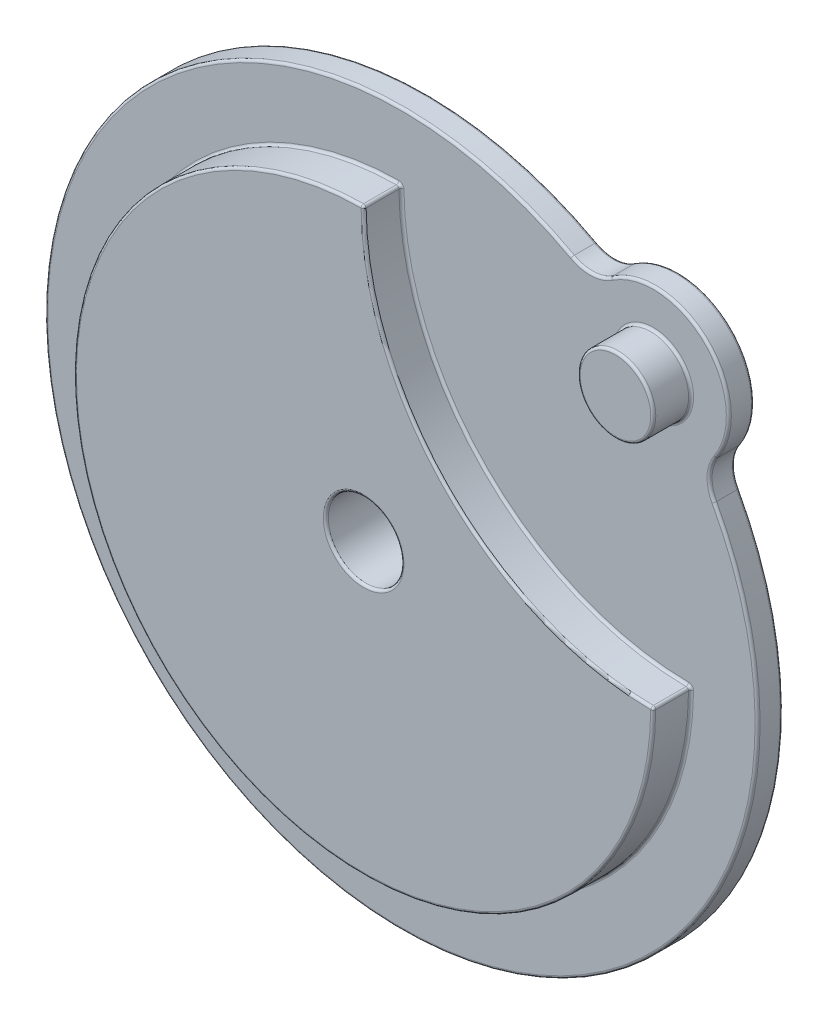
ISO-10303-21;
HEADER;
FILE_DESCRIPTION(('STEP AP214'),'2;1');
FILE_NAME('part.step','',(''),(''),'','','');
FILE_SCHEMA(('AUTOMOTIVE_DESIGN { 1 0 10303 214 1 1 1 1 }'));
ENDSEC;
DATA;
#1=APPLICATION_CONTEXT('core data for automotive mechanical design processes');
#2=APPLICATION_PROTOCOL_DEFINITION('international standard','automotive_design',2000,#1);
#3=PRODUCT_CONTEXT('',#1,'mechanical');
#4=PRODUCT('Part','Part','',(#3));
#5=PRODUCT_RELATED_PRODUCT_CATEGORY('part','',(#4));
#6=PRODUCT_DEFINITION_FORMATION('','',#4);
#7=PRODUCT_DEFINITION_CONTEXT('part definition',#1,'design');
#8=PRODUCT_DEFINITION('design','',#6,#7);
#9=PRODUCT_DEFINITION_SHAPE('','',#8);
#10=(LENGTH_UNIT() NAMED_UNIT(*) SI_UNIT(.MILLI.,.METRE.));
#11=(NAMED_UNIT(*) PLANE_ANGLE_UNIT() SI_UNIT($,.RADIAN.));
#12=(NAMED_UNIT(*) SI_UNIT($,.STERADIAN.) SOLID_ANGLE_UNIT());
#13=UNCERTAINTY_MEASURE_WITH_UNIT(LENGTH_MEASURE(1.E-05),#10,'distance_accuracy_value','');
#14=(GEOMETRIC_REPRESENTATION_CONTEXT(3) GLOBAL_UNCERTAINTY_ASSIGNED_CONTEXT((#13)) GLOBAL_UNIT_ASSIGNED_CONTEXT((#10,
#11,#12)) REPRESENTATION_CONTEXT('',''));
#15=CARTESIAN_POINT('',(0.,0.,0.));
#16=DIRECTION('',(0.,0.,1.));
#17=DIRECTION('',(1.,0.,0.));
#18=AXIS2_PLACEMENT_3D('',#15,#16,#17);
#19=CARTESIAN_POINT('',(-31.3325275695751,37.4391292873732,0.));
#20=DIRECTION('',(0.,0.,1.));
#21=DIRECTION('',(1.,0.,0.));
#22=AXIS2_PLACEMENT_3D('',#19,#20,#21);
#23=PLANE('',#22);
#24=CARTESIAN_POINT('',(-25.1217414252535,137.33494486085,0.));
#25=DIRECTION('',(0.,0.,1.));
#26=DIRECTION('',(1.,0.,0.));
#27=AXIS2_PLACEMENT_3D('',#24,#25,#26);
#28=CIRCLE('',#27,16.);
#29=CARTESIAN_POINT('',(-16.1895666962745,124.060297799214,0.));
#30=VERTEX_POINT('',#29);
#31=CARTESIAN_POINT('',(-32.7808754847892,123.287252329403,0.));
#32=VERTEX_POINT('',#31);
#33=EDGE_CURVE('E210',#30,#32,#28,.F.);
#34=ORIENTED_EDGE('',*,*,#33,.T.);
#35=CARTESIAN_POINT('',(-100.,0.,0.));
#36=DIRECTION('',(0.,0.,1.));
#37=DIRECTION('',(1.,0.,0.));
#38=AXIS2_PLACEMENT_3D('',#35,#36,#37);
#39=CIRCLE('',#38,140.421356237309);
#40=CARTESIAN_POINT('',(23.2872523294033,67.2191245152107,0.));
#41=VERTEX_POINT('',#40);
#42=EDGE_CURVE('E212',#32,#41,#39,.T.);
#43=ORIENTED_EDGE('',*,*,#42,.T.);
#44=CARTESIAN_POINT('',(37.3349448608499,74.8782585747464,0.));
#45=DIRECTION('',(0.,0.,1.));
#46=DIRECTION('',(1.,0.,0.));
#47=AXIS2_PLACEMENT_3D('',#44,#45,#46);
#48=CIRCLE('',#47,16.);
#49=CARTESIAN_POINT('',(24.0602977992144,83.8104333037254,0.));
#50=VERTEX_POINT('',#49);
#51=EDGE_CURVE('E206',#41,#50,#48,.F.);
#52=ORIENTED_EDGE('',*,*,#51,.T.);
#53=CARTESIAN_POINT('',(0.,99.9999999999999,0.));
#54=DIRECTION('',(0.,0.,1.));
#55=DIRECTION('',(1.,0.,0.));
#56=AXIS2_PLACEMENT_3D('',#53,#54,#55);
#57=CIRCLE('',#56,29.);
#58=EDGE_CURVE('E208',#50,#30,#57,.T.);
#59=ORIENTED_EDGE('',*,*,#58,.T.);
#60=EDGE_LOOP('',(#34,#43,#52,#59));
#61=FACE_BOUND('',#60,.T.);
#62=CARTESIAN_POINT('',(0.,99.9999999999999,0.));
#63=DIRECTION('',(0.,0.,1.));
#64=DIRECTION('',(1.,0.,0.));
#65=AXIS2_PLACEMENT_3D('',#62,#63,#64);
#66=CIRCLE('',#65,16.);
#67=CARTESIAN_POINT('',(16.,99.9999999999999,0.));
#68=VERTEX_POINT('',#67);
#69=EDGE_CURVE('E203',#68,#68,#66,.F.);
#70=ORIENTED_EDGE('',*,*,#69,.T.);
#71=EDGE_LOOP('',(#70));
#72=FACE_BOUND('',#71,.T.);
#73=CARTESIAN_POINT('',(13.9956520095216,-0.995652009521557,0.));
#74=DIRECTION('',(0.,0.,1.));
#75=DIRECTION('',(1.,0.,0.));
#76=AXIS2_PLACEMENT_3D('',#73,#74,#75);
#77=CIRCLE('',#76,2.);
#78=CARTESIAN_POINT('',(15.9955757289868,-1.01311958863597,0.));
#79=VERTEX_POINT('',#78);
#80=CARTESIAN_POINT('',(14.012968354185,1.00427302512538,0.));
#81=VERTEX_POINT('',#80);
#82=EDGE_CURVE('E192',#79,#81,#77,.T.);
#83=ORIENTED_EDGE('',*,*,#82,.F.);
#84=CARTESIAN_POINT('',(-100.,0.,0.));
#85=DIRECTION('',(0.,0.,1.));
#86=DIRECTION('',(1.,0.,0.));
#87=AXIS2_PLACEMENT_3D('',#84,#85,#86);
#88=CIRCLE('',#87,116.);
#89=CARTESIAN_POINT('',(-101.013119588636,115.995575728987,0.));
#90=VERTEX_POINT('',#89);
#91=EDGE_CURVE('E200',#79,#90,#88,.F.);
#92=ORIENTED_EDGE('',*,*,#91,.T.);
#93=CARTESIAN_POINT('',(-100.995652009522,113.995652009522,0.));
#94=DIRECTION('',(0.,0.,1.));
#95=DIRECTION('',(1.,0.,0.));
#96=AXIS2_PLACEMENT_3D('',#93,#94,#95);
#97=CIRCLE('',#96,2.);
#98=CARTESIAN_POINT('',(-98.9957269748746,114.012968354185,0.));
#99=VERTEX_POINT('',#98);
#100=EDGE_CURVE('E197',#99,#90,#97,.T.);
#101=ORIENTED_EDGE('',*,*,#100,.F.);
#102=CARTESIAN_POINT('',(15.0000000000001,115.,0.));
#103=DIRECTION('',(0.,0.,1.));
#104=DIRECTION('',(1.,0.,0.));
#105=AXIS2_PLACEMENT_3D('',#102,#103,#104);
#106=CIRCLE('',#105,114.);
#107=EDGE_CURVE('E195',#99,#81,#106,.T.);
#108=ORIENTED_EDGE('',*,*,#107,.T.);
#109=EDGE_LOOP('',(#83,#92,#101,#108));
#110=FACE_BOUND('',#109,.T.);
#111=ADVANCED_FACE('F34',(#61,#72,#110),#23,.T.);
#112=CARTESIAN_POINT('',(37.3349448608499,74.8782585747464,-10.));
#113=DIRECTION('',(0.,0.,1.));
#114=DIRECTION('',(1.,0.,0.));
#115=AXIS2_PLACEMENT_3D('',#112,#113,#114);
#116=CYLINDRICAL_SURFACE('',#115,15.);
#117=DIRECTION('',(0.,0.,1.));
#118=VECTOR('',#117,1.);
#119=CARTESIAN_POINT('',(24.8899632405666,83.2521723831643,-10.));
#120=LINE('',#119,#118);
#121=CARTESIAN_POINT('',(24.8899632405666,83.2521723831643,-9.));
#122=VERTEX_POINT('',#121);
#123=CARTESIAN_POINT('',(24.8899632405666,83.2521723831643,-0.999999999999999));
#124=VERTEX_POINT('',#123);
#125=EDGE_CURVE('E187',#122,#124,#120,.T.);
#126=ORIENTED_EDGE('',*,*,#125,.T.);
#127=CARTESIAN_POINT('',(37.3349448608499,74.8782585747464,-0.999999999999999));
#128=DIRECTION('',(0.,0.,1.));
#129=DIRECTION('',(1.,0.,0.));
#130=AXIS2_PLACEMENT_3D('',#127,#128,#129);
#131=CIRCLE('',#130,15.);
#132=CARTESIAN_POINT('',(24.1652331126187,67.6978203939317,-0.999999999999999));
#133=VERTEX_POINT('',#132);
#134=EDGE_CURVE('E231',#124,#133,#131,.T.);
#135=ORIENTED_EDGE('',*,*,#134,.T.);
#136=DIRECTION('',(0.,0.,1.));
#137=VECTOR('',#136,1.);
#138=CARTESIAN_POINT('',(24.1652331126187,67.6978203939317,-10.));
#139=LINE('',#138,#137);
#140=CARTESIAN_POINT('',(24.1652331126187,67.6978203939317,-9.));
#141=VERTEX_POINT('',#140);
#142=EDGE_CURVE('E181',#141,#133,#139,.T.);
#143=ORIENTED_EDGE('',*,*,#142,.F.);
#144=CARTESIAN_POINT('',(37.3349448608499,74.8782585747464,-9.));
#145=DIRECTION('',(0.,0.,1.));
#146=DIRECTION('',(1.,0.,0.));
#147=AXIS2_PLACEMENT_3D('',#144,#145,#146);
#148=CIRCLE('',#147,15.);
#149=EDGE_CURVE('E228',#141,#122,#148,.F.);
#150=ORIENTED_EDGE('',*,*,#149,.T.);
#151=EDGE_LOOP('',(#126,#135,#143,#150));
#152=FACE_BOUND('',#151,.T.);
#153=ADVANCED_FACE('F336',(#152),#116,.F.);
#154=CARTESIAN_POINT('',(-100.,0.,-10.));
#155=DIRECTION('',(0.,0.,1.));
#156=DIRECTION('',(1.,0.,0.));
#157=AXIS2_PLACEMENT_3D('',#154,#155,#156);
#158=CYLINDRICAL_SURFACE('',#157,141.421356237309);
#159=ORIENTED_EDGE('',*,*,#142,.T.);
#160=CARTESIAN_POINT('',(-100.,0.,-0.999999999999999));
#161=DIRECTION('',(0.,0.,1.));
#162=DIRECTION('',(1.,0.,0.));
#163=AXIS2_PLACEMENT_3D('',#160,#161,#162);
#164=CIRCLE('',#163,141.421356237309);
#165=CARTESIAN_POINT('',(-32.3021796060682,124.165233112619,-0.999999999999999));
#166=VERTEX_POINT('',#165);
#167=EDGE_CURVE('E217',#133,#166,#164,.F.);
#168=ORIENTED_EDGE('',*,*,#167,.T.);
#169=DIRECTION('',(0.,0.,1.));
#170=VECTOR('',#169,1.);
#171=CARTESIAN_POINT('',(-32.3021796060682,124.165233112619,-10.));
#172=LINE('',#171,#170);
#173=CARTESIAN_POINT('',(-32.3021796060682,124.165233112619,-9.));
#174=VERTEX_POINT('',#173);
#175=EDGE_CURVE('E184',#174,#166,#172,.T.);
#176=ORIENTED_EDGE('',*,*,#175,.F.);
#177=CARTESIAN_POINT('',(-100.,0.,-9.));
#178=DIRECTION('',(0.,0.,1.));
#179=DIRECTION('',(1.,0.,0.));
#180=AXIS2_PLACEMENT_3D('',#177,#178,#179);
#181=CIRCLE('',#180,141.421356237309);
#182=EDGE_CURVE('E215',#174,#141,#181,.T.);
#183=ORIENTED_EDGE('',*,*,#182,.T.);
#184=EDGE_LOOP('',(#159,#168,#176,#183));
#185=FACE_BOUND('',#184,.T.);
#186=ADVANCED_FACE('F341',(#185),#158,.T.);
#187=CARTESIAN_POINT('',(-25.1217414252535,137.33494486085,-10.));
#188=DIRECTION('',(0.,0.,1.));
#189=DIRECTION('',(1.,0.,0.));
#190=AXIS2_PLACEMENT_3D('',#187,#188,#189);
#191=CYLINDRICAL_SURFACE('',#190,15.);
#192=ORIENTED_EDGE('',*,*,#175,.T.);
#193=CARTESIAN_POINT('',(-25.1217414252535,137.33494486085,-0.999999999999999));
#194=DIRECTION('',(0.,0.,1.));
#195=DIRECTION('',(1.,0.,0.));
#196=AXIS2_PLACEMENT_3D('',#193,#194,#195);
#197=CIRCLE('',#196,15.);
#198=CARTESIAN_POINT('',(-16.7478276168357,124.889963240567,-0.999999999999999));
#199=VERTEX_POINT('',#198);
#200=EDGE_CURVE('E222',#166,#199,#197,.T.);
#201=ORIENTED_EDGE('',*,*,#200,.T.);
#202=DIRECTION('',(0.,0.,1.));
#203=VECTOR('',#202,1.);
#204=CARTESIAN_POINT('',(-16.7478276168357,124.889963240567,-10.));
#205=LINE('',#204,#203);
#206=CARTESIAN_POINT('',(-16.7478276168357,124.889963240567,-9.));
#207=VERTEX_POINT('',#206);
#208=EDGE_CURVE('E687',#207,#199,#205,.T.);
#209=ORIENTED_EDGE('',*,*,#208,.F.);
#210=CARTESIAN_POINT('',(-25.1217414252535,137.33494486085,-9.));
#211=DIRECTION('',(0.,0.,1.));
#212=DIRECTION('',(1.,0.,0.));
#213=AXIS2_PLACEMENT_3D('',#210,#211,#212);
#214=CIRCLE('',#213,15.);
#215=EDGE_CURVE('E220',#207,#174,#214,.F.);
#216=ORIENTED_EDGE('',*,*,#215,.T.);
#217=EDGE_LOOP('',(#192,#201,#209,#216));
#218=FACE_BOUND('',#217,.T.);
#219=ADVANCED_FACE('F331',(#218),#191,.F.);
#220=CARTESIAN_POINT('',(0.,99.9999999999999,-10.));
#221=DIRECTION('',(0.,0.,1.));
#222=DIRECTION('',(1.,0.,0.));
#223=AXIS2_PLACEMENT_3D('',#220,#221,#222);
#224=CYLINDRICAL_SURFACE('',#223,30.);
#225=ORIENTED_EDGE('',*,*,#208,.T.);
#226=CARTESIAN_POINT('',(0.,99.9999999999999,-0.999999999999999));
#227=DIRECTION('',(0.,0.,1.));
#228=DIRECTION('',(1.,0.,0.));
#229=AXIS2_PLACEMENT_3D('',#226,#227,#228);
#230=CIRCLE('',#229,30.);
#231=EDGE_CURVE('E226',#199,#124,#230,.F.);
#232=ORIENTED_EDGE('',*,*,#231,.T.);
#233=ORIENTED_EDGE('',*,*,#125,.F.);
#234=CARTESIAN_POINT('',(0.,99.9999999999999,-9.));
#235=DIRECTION('',(0.,0.,1.));
#236=DIRECTION('',(1.,0.,0.));
#237=AXIS2_PLACEMENT_3D('',#234,#235,#236);
#238=CIRCLE('',#237,30.);
#239=EDGE_CURVE('E224',#122,#207,#238,.T.);
#240=ORIENTED_EDGE('',*,*,#239,.T.);
#241=EDGE_LOOP('',(#225,#232,#233,#240));
#242=FACE_BOUND('',#241,.T.);
#243=ADVANCED_FACE('F321',(#242),#224,.T.);
#244=CARTESIAN_POINT('',(-31.3325275695751,37.4391292873732,-10.));
#245=DIRECTION('',(0.,0.,1.));
#246=DIRECTION('',(1.,0.,0.));
#247=AXIS2_PLACEMENT_3D('',#244,#245,#246);
#248=PLANE('',#247);
#249=CARTESIAN_POINT('',(-100.,0.,-10.));
#250=DIRECTION('',(0.,0.,1.));
#251=DIRECTION('',(1.,0.,0.));
#252=AXIS2_PLACEMENT_3D('',#249,#250,#251);
#253=CIRCLE('',#252,16.);
#254=CARTESIAN_POINT('',(-84.,0.,-10.));
#255=VERTEX_POINT('',#254);
#256=EDGE_CURVE('E43',#255,#255,#253,.T.);
#257=ORIENTED_EDGE('',*,*,#256,.T.);
#258=EDGE_LOOP('',(#257));
#259=FACE_BOUND('',#258,.T.);
#260=CARTESIAN_POINT('',(0.,99.9999999999999,-10.));
#261=DIRECTION('',(0.,0.,1.));
#262=DIRECTION('',(1.,0.,0.));
#263=AXIS2_PLACEMENT_3D('',#260,#261,#262);
#264=CIRCLE('',#263,29.);
#265=CARTESIAN_POINT('',(-16.1895666962745,124.060297799214,-10.));
#266=VERTEX_POINT('',#265);
#267=CARTESIAN_POINT('',(24.0602977992144,83.8104333037254,-10.));
#268=VERTEX_POINT('',#267);
#269=EDGE_CURVE('E51',#266,#268,#264,.F.);
#270=ORIENTED_EDGE('',*,*,#269,.T.);
#271=CARTESIAN_POINT('',(37.3349448608499,74.8782585747464,-10.));
#272=DIRECTION('',(0.,0.,1.));
#273=DIRECTION('',(1.,0.,0.));
#274=AXIS2_PLACEMENT_3D('',#271,#272,#273);
#275=CIRCLE('',#274,16.);
#276=CARTESIAN_POINT('',(23.2872523294033,67.2191245152107,-10.));
#277=VERTEX_POINT('',#276);
#278=EDGE_CURVE('E264',#268,#277,#275,.T.);
#279=ORIENTED_EDGE('',*,*,#278,.T.);
#280=CARTESIAN_POINT('',(-100.,0.,-10.));
#281=DIRECTION('',(0.,0.,1.));
#282=DIRECTION('',(1.,0.,0.));
#283=AXIS2_PLACEMENT_3D('',#280,#281,#282);
#284=CIRCLE('',#283,140.421356237309);
#285=CARTESIAN_POINT('',(-32.7808754847892,123.287252329403,-10.));
#286=VERTEX_POINT('',#285);
#287=EDGE_CURVE('E260',#277,#286,#284,.F.);
#288=ORIENTED_EDGE('',*,*,#287,.T.);
#289=CARTESIAN_POINT('',(-25.1217414252535,137.33494486085,-10.));
#290=DIRECTION('',(0.,0.,1.));
#291=DIRECTION('',(1.,0.,0.));
#292=AXIS2_PLACEMENT_3D('',#289,#290,#291);
#293=CIRCLE('',#292,16.);
#294=EDGE_CURVE('E56',#286,#266,#293,.T.);
#295=ORIENTED_EDGE('',*,*,#294,.T.);
#296=EDGE_LOOP('',(#270,#279,#288,#295));
#297=FACE_BOUND('',#296,.T.);
#298=ADVANCED_FACE('F318',(#259,#297),#248,.F.);
#299=CARTESIAN_POINT('',(0.,99.9999999999999,15.));
#300=DIRECTION('',(0.,0.,-1.));
#301=DIRECTION('',(-1.,0.,0.));
#302=AXIS2_PLACEMENT_3D('',#299,#300,#301);
#303=CYLINDRICAL_SURFACE('',#302,15.);
#304=CARTESIAN_POINT('',(0.,99.9999999999999,1.));
#305=DIRECTION('',(0.,0.,1.));
#306=DIRECTION('',(1.,0.,0.));
#307=AXIS2_PLACEMENT_3D('',#304,#305,#306);
#308=CIRCLE('',#307,15.);
#309=CARTESIAN_POINT('',(15.,99.9999999999999,1.));
#310=VERTEX_POINT('',#309);
#311=EDGE_CURVE('E257',#310,#310,#308,.T.);
#312=ORIENTED_EDGE('',*,*,#311,.T.);
#313=EDGE_LOOP('',(#312));
#314=FACE_BOUND('',#313,.T.);
#315=CARTESIAN_POINT('',(0.,99.9999999999999,14.));
#316=DIRECTION('',(0.,0.,1.));
#317=DIRECTION('',(1.,0.,0.));
#318=AXIS2_PLACEMENT_3D('',#315,#316,#317);
#319=CIRCLE('',#318,15.);
#320=CARTESIAN_POINT('',(15.,99.9999999999999,14.));
#321=VERTEX_POINT('',#320);
#322=EDGE_CURVE('E254',#321,#321,#319,.F.);
#323=ORIENTED_EDGE('',*,*,#322,.T.);
#324=EDGE_LOOP('',(#323));
#325=FACE_BOUND('',#324,.T.);
#326=ADVANCED_FACE('F320',(#314,#325),#303,.T.);
#327=CARTESIAN_POINT('',(0.,99.9999999999999,15.));
#328=DIRECTION('',(0.,0.,1.));
#329=DIRECTION('',(1.,0.,0.));
#330=AXIS2_PLACEMENT_3D('',#327,#328,#329);
#331=PLANE('',#330);
#332=CARTESIAN_POINT('',(0.,99.9999999999999,15.));
#333=DIRECTION('',(0.,0.,1.));
#334=DIRECTION('',(1.,0.,0.));
#335=AXIS2_PLACEMENT_3D('',#332,#333,#334);
#336=CIRCLE('',#335,14.);
#337=CARTESIAN_POINT('',(14.,99.9999999999999,15.));
#338=VERTEX_POINT('',#337);
#339=EDGE_CURVE('E11',#338,#338,#336,.T.);
#340=ORIENTED_EDGE('',*,*,#339,.T.);
#341=EDGE_LOOP('',(#340));
#342=FACE_BOUND('',#341,.T.);
#343=ADVANCED_FACE('F328',(#342),#331,.T.);
#344=CARTESIAN_POINT('',(15.0000000000001,115.,15.));
#345=DIRECTION('',(0.,0.,-1.));
#346=DIRECTION('',(-1.,0.,0.));
#347=AXIS2_PLACEMENT_3D('',#344,#345,#346);
#348=CYLINDRICAL_SURFACE('',#347,115.);
#349=CARTESIAN_POINT('',(15.0000000000001,115.,14.));
#350=DIRECTION('',(0.,0.,-1.));
#351=DIRECTION('',(-1.,0.,0.));
#352=AXIS2_PLACEMENT_3D('',#349,#350,#351);
#353=CIRCLE('',#352,115.);
#354=CARTESIAN_POINT('',(-99.9956894921981,114.004310181853,14.));
#355=VERTEX_POINT('',#354);
#356=CARTESIAN_POINT('',(14.0043101818533,0.00431050780190367,14.));
#357=VERTEX_POINT('',#356);
#358=EDGE_CURVE('E249',#355,#357,#353,.F.);
#359=ORIENTED_EDGE('',*,*,#358,.T.);
#360=DIRECTION('',(0.,0.,-1.));
#361=VECTOR('',#360,1.);
#362=CARTESIAN_POINT('',(14.0043101818533,0.00431050780190512,15.));
#363=LINE('',#362,#361);
#364=CARTESIAN_POINT('',(14.0043101818533,0.00431050780190367,1.));
#365=VERTEX_POINT('',#364);
#366=EDGE_CURVE('E252',#357,#365,#363,.T.);
#367=ORIENTED_EDGE('',*,*,#366,.T.);
#368=CARTESIAN_POINT('',(15.0000000000001,115.,1.));
#369=DIRECTION('',(0.,0.,1.));
#370=DIRECTION('',(1.,0.,0.));
#371=AXIS2_PLACEMENT_3D('',#368,#369,#370);
#372=CIRCLE('',#371,115.);
#373=CARTESIAN_POINT('',(-99.9956894921981,114.004310181853,1.));
#374=VERTEX_POINT('',#373);
#375=EDGE_CURVE('E247',#365,#374,#372,.F.);
#376=ORIENTED_EDGE('',*,*,#375,.T.);
#377=DIRECTION('',(0.,0.,-1.));
#378=VECTOR('',#377,1.);
#379=CARTESIAN_POINT('',(-99.9956894921981,114.004310181853,15.));
#380=LINE('',#379,#378);
#381=EDGE_CURVE('E245',#374,#355,#380,.F.);
#382=ORIENTED_EDGE('',*,*,#381,.T.);
#383=EDGE_LOOP('',(#359,#367,#376,#382));
#384=FACE_BOUND('',#383,.T.);
#385=ADVANCED_FACE('F542',(#384),#348,.F.);
#386=CARTESIAN_POINT('',(-100.,0.,15.));
#387=DIRECTION('',(0.,0.,-1.));
#388=DIRECTION('',(-1.,0.,0.));
#389=AXIS2_PLACEMENT_3D('',#386,#387,#388);
#390=CYLINDRICAL_SURFACE('',#389,115.);
#391=CARTESIAN_POINT('',(-100.,0.,1.));
#392=DIRECTION('',(0.,0.,1.));
#393=DIRECTION('',(1.,0.,0.));
#394=AXIS2_PLACEMENT_3D('',#391,#392,#393);
#395=CIRCLE('',#394,115.);
#396=CARTESIAN_POINT('',(-101.004385799079,114.995613869254,1.));
#397=VERTEX_POINT('',#396);
#398=CARTESIAN_POINT('',(14.9956138692542,-1.00438579907876,1.));
#399=VERTEX_POINT('',#398);
#400=EDGE_CURVE('E154',#397,#399,#395,.T.);
#401=ORIENTED_EDGE('',*,*,#400,.T.);
#402=DIRECTION('',(0.,0.,-1.));
#403=VECTOR('',#402,1.);
#404=CARTESIAN_POINT('',(14.9956138692542,-1.00438579907876,15.));
#405=LINE('',#404,#403);
#406=CARTESIAN_POINT('',(14.9956138692542,-1.00438579907876,14.));
#407=VERTEX_POINT('',#406);
#408=EDGE_CURVE('E150',#399,#407,#405,.F.);
#409=ORIENTED_EDGE('',*,*,#408,.T.);
#410=CARTESIAN_POINT('',(-100.,0.,14.));
#411=DIRECTION('',(0.,0.,-1.));
#412=DIRECTION('',(-1.,0.,0.));
#413=AXIS2_PLACEMENT_3D('',#410,#411,#412);
#414=CIRCLE('',#413,115.);
#415=CARTESIAN_POINT('',(-101.004385799079,114.995613869254,14.));
#416=VERTEX_POINT('',#415);
#417=EDGE_CURVE('E142',#407,#416,#414,.T.);
#418=ORIENTED_EDGE('',*,*,#417,.T.);
#419=DIRECTION('',(0.,0.,-1.));
#420=VECTOR('',#419,1.);
#421=CARTESIAN_POINT('',(-101.004385799079,114.995613869254,15.));
#422=LINE('',#421,#420);
#423=EDGE_CURVE('E147',#416,#397,#422,.T.);
#424=ORIENTED_EDGE('',*,*,#423,.T.);
#425=EDGE_LOOP('',(#401,#409,#418,#424));
#426=FACE_BOUND('',#425,.T.);
#427=ADVANCED_FACE('F145',(#426),#390,.T.);
#428=CARTESIAN_POINT('',(-42.5,57.5,15.));
#429=DIRECTION('',(0.,0.,-1.));
#430=DIRECTION('',(-1.,0.,0.));
#431=AXIS2_PLACEMENT_3D('',#428,#429,#430);
#432=PLANE('',#431);
#433=CARTESIAN_POINT('',(-100.,0.,15.));
#434=DIRECTION('',(0.,0.,-1.));
#435=DIRECTION('',(-1.,0.,0.));
#436=AXIS2_PLACEMENT_3D('',#433,#434,#435);
#437=CIRCLE('',#436,16.);
#438=CARTESIAN_POINT('',(-116.,0.,15.));
#439=VERTEX_POINT('',#438);
#440=EDGE_CURVE('E242',#439,#439,#437,.T.);
#441=ORIENTED_EDGE('',*,*,#440,.T.);
#442=EDGE_LOOP('',(#441));
#443=FACE_BOUND('',#442,.T.);
#444=CARTESIAN_POINT('',(15.0000000000001,115.,15.));
#445=DIRECTION('',(0.,0.,-1.));
#446=DIRECTION('',(-1.,0.,0.));
#447=AXIS2_PLACEMENT_3D('',#444,#445,#446);
#448=CIRCLE('',#447,116.);
#449=CARTESIAN_POINT('',(13.9956520095215,-0.995652009521547,15.));
#450=VERTEX_POINT('',#449);
#451=CARTESIAN_POINT('',(-100.995652009522,113.995652009522,15.));
#452=VERTEX_POINT('',#451);
#453=EDGE_CURVE('E239',#450,#452,#448,.T.);
#454=ORIENTED_EDGE('',*,*,#453,.T.);
#455=CARTESIAN_POINT('',(-100.,0.,15.));
#456=DIRECTION('',(0.,0.,-1.));
#457=DIRECTION('',(-1.,0.,0.));
#458=AXIS2_PLACEMENT_3D('',#455,#456,#457);
#459=CIRCLE('',#458,114.);
#460=EDGE_CURVE('E162',#452,#450,#459,.F.);
#461=ORIENTED_EDGE('',*,*,#460,.T.);
#462=EDGE_LOOP('',(#454,#461));
#463=FACE_BOUND('',#462,.T.);
#464=ADVANCED_FACE('F525',(#443,#463),#432,.F.);
#465=CARTESIAN_POINT('',(-100.,0.,-10.));
#466=DIRECTION('',(0.,0.,1.));
#467=DIRECTION('',(1.,0.,0.));
#468=AXIS2_PLACEMENT_3D('',#465,#466,#467);
#469=CYLINDRICAL_SURFACE('',#468,15.);
#470=CARTESIAN_POINT('',(-100.,0.,14.));
#471=DIRECTION('',(0.,0.,-1.));
#472=DIRECTION('',(-1.,0.,0.));
#473=AXIS2_PLACEMENT_3D('',#470,#471,#472);
#474=CIRCLE('',#473,15.);
#475=CARTESIAN_POINT('',(-115.,0.,14.));
#476=VERTEX_POINT('',#475);
#477=EDGE_CURVE('E236',#476,#476,#474,.F.);
#478=ORIENTED_EDGE('',*,*,#477,.T.);
#479=EDGE_LOOP('',(#478));
#480=FACE_BOUND('',#479,.T.);
#481=CARTESIAN_POINT('',(-100.,0.,-9.));
#482=DIRECTION('',(0.,0.,1.));
#483=DIRECTION('',(1.,0.,0.));
#484=AXIS2_PLACEMENT_3D('',#481,#482,#483);
#485=CIRCLE('',#484,15.);
#486=CARTESIAN_POINT('',(-85.,0.,-9.));
#487=VERTEX_POINT('',#486);
#488=EDGE_CURVE('E233',#487,#487,#485,.F.);
#489=ORIENTED_EDGE('',*,*,#488,.T.);
#490=EDGE_LOOP('',(#489));
#491=FACE_BOUND('',#490,.T.);
#492=ADVANCED_FACE('F387',(#480,#491),#469,.F.);
#493=CARTESIAN_POINT('',(-100.,0.,14.));
#494=DIRECTION('',(0.,0.,-1.));
#495=DIRECTION('',(-1.,0.,0.));
#496=AXIS2_PLACEMENT_3D('',#493,#494,#495);
#497=TOROIDAL_SURFACE('',#496,114.,1.);
#498=CARTESIAN_POINT('',(13.9956520095215,-0.995652009521561,14.));
#499=DIRECTION('',(0.00873378955720269,0.999961859732645,0.));
#500=DIRECTION('',(-0.999961859732645,0.0087337895572027,0.));
#501=AXIS2_PLACEMENT_3D('',#498,#499,#500);
#502=CIRCLE('',#501,1.);
#503=EDGE_CURVE('E167',#450,#407,#502,.T.);
#504=ORIENTED_EDGE('',*,*,#503,.F.);
#505=ORIENTED_EDGE('',*,*,#460,.F.);
#506=CARTESIAN_POINT('',(-100.995652009522,113.995652009522,14.));
#507=DIRECTION('',(0.999961859732645,0.00873378955720821,0.));
#508=DIRECTION('',(-0.00873378955720821,0.999961859732645,0.));
#509=AXIS2_PLACEMENT_3D('',#506,#507,#508);
#510=CIRCLE('',#509,1.);
#511=EDGE_CURVE('E158',#416,#452,#510,.T.);
#512=ORIENTED_EDGE('',*,*,#511,.F.);
#513=ORIENTED_EDGE('',*,*,#417,.F.);
#514=EDGE_LOOP('',(#504,#505,#512,#513));
#515=FACE_BOUND('',#514,.T.);
#516=ADVANCED_FACE('F160',(#515),#497,.T.);
#517=CARTESIAN_POINT('',(15.0000000000001,115.,14.));
#518=DIRECTION('',(0.,0.,-1.));
#519=DIRECTION('',(-1.,0.,0.));
#520=AXIS2_PLACEMENT_3D('',#517,#518,#519);
#521=TOROIDAL_SURFACE('',#520,116.,1.);
#522=CARTESIAN_POINT('',(-100.995652009522,113.995652009522,14.));
#523=DIRECTION('',(-0.00865817233172676,0.999962517323461,0.));
#524=DIRECTION('',(-0.999962517323462,-0.00865817233172676,0.));
#525=AXIS2_PLACEMENT_3D('',#522,#523,#524);
#526=CIRCLE('',#525,1.);
#527=EDGE_CURVE('E166',#452,#355,#526,.T.);
#528=ORIENTED_EDGE('',*,*,#527,.F.);
#529=ORIENTED_EDGE('',*,*,#453,.F.);
#530=CARTESIAN_POINT('',(13.9956520095216,-0.995652009521558,14.));
#531=DIRECTION('',(0.999962517323462,-0.00865817233171133,0.));
#532=DIRECTION('',(0.00865817233171133,0.999962517323462,0.));
#533=AXIS2_PLACEMENT_3D('',#530,#531,#532);
#534=CIRCLE('',#533,1.);
#535=EDGE_CURVE('E174',#357,#450,#534,.T.);
#536=ORIENTED_EDGE('',*,*,#535,.F.);
#537=ORIENTED_EDGE('',*,*,#358,.F.);
#538=EDGE_LOOP('',(#528,#529,#536,#537));
#539=FACE_BOUND('',#538,.T.);
#540=ADVANCED_FACE('F381',(#539),#521,.T.);
#541=CARTESIAN_POINT('',(-100.995652009522,113.995652009522,14.));
#542=DIRECTION('',(0.,0.,1.));
#543=DIRECTION('',(1.,0.,0.));
#544=AXIS2_PLACEMENT_3D('',#541,#542,#543);
#545=SPHERICAL_SURFACE('',#544,1.);
#546=ORIENTED_EDGE('',*,*,#511,.T.);
#547=ORIENTED_EDGE('',*,*,#527,.T.);
#548=CARTESIAN_POINT('',(-100.995652009522,113.995652009522,14.));
#549=DIRECTION('',(0.,0.,1.));
#550=DIRECTION('',(1.,0.,0.));
#551=AXIS2_PLACEMENT_3D('',#548,#549,#550);
#552=CIRCLE('',#551,1.);
#553=EDGE_CURVE('E170',#416,#355,#552,.F.);
#554=ORIENTED_EDGE('',*,*,#553,.F.);
#555=EDGE_LOOP('',(#546,#547,#554));
#556=FACE_BOUND('',#555,.T.);
#557=ADVANCED_FACE('F171',(#556),#545,.T.);
#558=CARTESIAN_POINT('',(13.9956520095216,-0.995652009521544,14.));
#559=DIRECTION('',(0.,0.,1.));
#560=DIRECTION('',(1.,0.,0.));
#561=AXIS2_PLACEMENT_3D('',#558,#559,#560);
#562=SPHERICAL_SURFACE('',#561,1.);
#563=ORIENTED_EDGE('',*,*,#535,.T.);
#564=ORIENTED_EDGE('',*,*,#503,.T.);
#565=CARTESIAN_POINT('',(13.9956520095216,-0.995652009521557,14.));
#566=DIRECTION('',(0.,0.,1.));
#567=DIRECTION('',(1.,0.,0.));
#568=AXIS2_PLACEMENT_3D('',#565,#566,#567);
#569=CIRCLE('',#568,1.);
#570=EDGE_CURVE('E175',#357,#407,#569,.F.);
#571=ORIENTED_EDGE('',*,*,#570,.F.);
#572=EDGE_LOOP('',(#563,#564,#571));
#573=FACE_BOUND('',#572,.T.);
#574=ADVANCED_FACE('F375',(#573),#562,.T.);
#575=CARTESIAN_POINT('',(-100.995652009522,113.995652009522,15.));
#576=DIRECTION('',(0.,0.,1.));
#577=DIRECTION('',(1.,0.,0.));
#578=AXIS2_PLACEMENT_3D('',#575,#576,#577);
#579=CYLINDRICAL_SURFACE('',#578,1.);
#580=ORIENTED_EDGE('',*,*,#553,.T.);
#581=ORIENTED_EDGE('',*,*,#381,.F.);
#582=CARTESIAN_POINT('',(-100.995652009522,113.995652009522,1.));
#583=DIRECTION('',(0.,0.,1.));
#584=DIRECTION('',(1.,0.,0.));
#585=AXIS2_PLACEMENT_3D('',#582,#583,#584);
#586=CIRCLE('',#585,1.);
#587=EDGE_CURVE('E179',#397,#374,#586,.F.);
#588=ORIENTED_EDGE('',*,*,#587,.F.);
#589=ORIENTED_EDGE('',*,*,#423,.F.);
#590=EDGE_LOOP('',(#580,#581,#588,#589));
#591=FACE_BOUND('',#590,.T.);
#592=ADVANCED_FACE('F177',(#591),#579,.T.);
#593=CARTESIAN_POINT('',(13.9956520095216,-0.995652009521557,15.));
#594=DIRECTION('',(0.,0.,1.));
#595=DIRECTION('',(1.,0.,0.));
#596=AXIS2_PLACEMENT_3D('',#593,#594,#595);
#597=CYLINDRICAL_SURFACE('',#596,1.);
#598=ORIENTED_EDGE('',*,*,#570,.T.);
#599=ORIENTED_EDGE('',*,*,#408,.F.);
#600=CARTESIAN_POINT('',(13.9956520095216,-0.995652009521557,1.));
#601=DIRECTION('',(0.,0.,1.));
#602=DIRECTION('',(1.,0.,0.));
#603=AXIS2_PLACEMENT_3D('',#600,#601,#602);
#604=CIRCLE('',#603,1.);
#605=EDGE_CURVE('E276',#365,#399,#604,.F.);
#606=ORIENTED_EDGE('',*,*,#605,.F.);
#607=ORIENTED_EDGE('',*,*,#366,.F.);
#608=EDGE_LOOP('',(#598,#599,#606,#607));
#609=FACE_BOUND('',#608,.T.);
#610=ADVANCED_FACE('F368',(#609),#597,.T.);
#611=CARTESIAN_POINT('',(15.0000000000001,115.,1.));
#612=DIRECTION('',(0.,0.,1.));
#613=DIRECTION('',(1.,0.,0.));
#614=AXIS2_PLACEMENT_3D('',#611,#612,#613);
#615=TOROIDAL_SURFACE('',#614,114.,1.);
#616=CARTESIAN_POINT('',(14.012968354185,1.00427302512538,1.));
#617=DIRECTION('',(-0.999962517323462,0.00865817233171121,0.));
#618=DIRECTION('',(-0.00865817233171121,-0.999962517323462,0.));
#619=AXIS2_PLACEMENT_3D('',#616,#617,#618);
#620=CIRCLE('',#619,1.);
#621=EDGE_CURVE('E273',#81,#365,#620,.T.);
#622=ORIENTED_EDGE('',*,*,#621,.F.);
#623=ORIENTED_EDGE('',*,*,#107,.F.);
#624=CARTESIAN_POINT('',(-98.9957269748746,114.012968354185,1.));
#625=DIRECTION('',(0.00865817233171312,-0.999962517323462,0.));
#626=DIRECTION('',(0.999962517323462,0.00865817233171312,0.));
#627=AXIS2_PLACEMENT_3D('',#624,#625,#626);
#628=CIRCLE('',#627,1.);
#629=EDGE_CURVE('E280',#374,#99,#628,.T.);
#630=ORIENTED_EDGE('',*,*,#629,.F.);
#631=ORIENTED_EDGE('',*,*,#375,.F.);
#632=EDGE_LOOP('',(#622,#623,#630,#631));
#633=FACE_BOUND('',#632,.T.);
#634=ADVANCED_FACE('F364',(#633),#615,.F.);
#635=CARTESIAN_POINT('',(-100.995652009522,113.995652009522,1.));
#636=DIRECTION('',(0.,0.,1.));
#637=DIRECTION('',(1.,0.,0.));
#638=AXIS2_PLACEMENT_3D('',#635,#636,#637);
#639=TOROIDAL_SURFACE('',#638,2.,1.);
#640=ORIENTED_EDGE('',*,*,#629,.T.);
#641=ORIENTED_EDGE('',*,*,#100,.T.);
#642=CARTESIAN_POINT('',(-101.013119588636,115.995575728987,1.));
#643=DIRECTION('',(-0.999961859732645,-0.00873378955720821,0.));
#644=DIRECTION('',(0.00873378955720821,-0.999961859732645,0.));
#645=AXIS2_PLACEMENT_3D('',#642,#643,#644);
#646=CIRCLE('',#645,1.);
#647=EDGE_CURVE('E270',#397,#90,#646,.F.);
#648=ORIENTED_EDGE('',*,*,#647,.F.);
#649=ORIENTED_EDGE('',*,*,#587,.T.);
#650=EDGE_LOOP('',(#640,#641,#648,#649));
#651=FACE_BOUND('',#650,.T.);
#652=ADVANCED_FACE('F360',(#651),#639,.F.);
#653=CARTESIAN_POINT('',(13.9956520095216,-0.995652009521557,1.));
#654=DIRECTION('',(0.,0.,1.));
#655=DIRECTION('',(1.,0.,0.));
#656=AXIS2_PLACEMENT_3D('',#653,#654,#655);
#657=TOROIDAL_SURFACE('',#656,2.,1.);
#658=ORIENTED_EDGE('',*,*,#621,.T.);
#659=ORIENTED_EDGE('',*,*,#605,.T.);
#660=CARTESIAN_POINT('',(15.9955757289868,-1.01311958863597,1.));
#661=DIRECTION('',(-0.00873378955720664,-0.999961859732645,0.));
#662=DIRECTION('',(0.999961859732645,-0.00873378955720664,0.));
#663=AXIS2_PLACEMENT_3D('',#660,#661,#662);
#664=CIRCLE('',#663,1.);
#665=EDGE_CURVE('E268',#79,#399,#664,.F.);
#666=ORIENTED_EDGE('',*,*,#665,.F.);
#667=ORIENTED_EDGE('',*,*,#82,.T.);
#668=EDGE_LOOP('',(#658,#659,#666,#667));
#669=FACE_BOUND('',#668,.T.);
#670=ADVANCED_FACE('F356',(#669),#657,.F.);
#671=CARTESIAN_POINT('',(-100.,0.,1.));
#672=DIRECTION('',(0.,0.,1.));
#673=DIRECTION('',(1.,0.,0.));
#674=AXIS2_PLACEMENT_3D('',#671,#672,#673);
#675=TOROIDAL_SURFACE('',#674,116.,1.);
#676=ORIENTED_EDGE('',*,*,#647,.T.);
#677=ORIENTED_EDGE('',*,*,#91,.F.);
#678=ORIENTED_EDGE('',*,*,#665,.T.);
#679=ORIENTED_EDGE('',*,*,#400,.F.);
#680=EDGE_LOOP('',(#676,#677,#678,#679));
#681=FACE_BOUND('',#680,.T.);
#682=ADVANCED_FACE('F352',(#681),#675,.F.);
#683=CARTESIAN_POINT('',(0.,99.9999999999999,-0.999999999999999));
#684=DIRECTION('',(0.,0.,1.));
#685=DIRECTION('',(1.,0.,0.));
#686=AXIS2_PLACEMENT_3D('',#683,#684,#685);
#687=TOROIDAL_SURFACE('',#686,29.,1.);
#688=CARTESIAN_POINT('',(24.0602977992144,83.8104333037254,-0.999999999999999));
#689=DIRECTION('',(-0.558260920561188,-0.82966544135222,0.));
#690=DIRECTION('',(0.82966544135222,-0.558260920561189,0.));
#691=AXIS2_PLACEMENT_3D('',#688,#689,#690);
#692=CIRCLE('',#691,1.);
#693=EDGE_CURVE('E292',#124,#50,#692,.T.);
#694=ORIENTED_EDGE('',*,*,#693,.F.);
#695=ORIENTED_EDGE('',*,*,#231,.F.);
#696=CARTESIAN_POINT('',(-16.1895666962745,124.060297799214,-1.));
#697=DIRECTION('',(-0.829665441352221,-0.558260920561187,0.));
#698=DIRECTION('',(0.558260920561187,-0.829665441352221,0.));
#699=AXIS2_PLACEMENT_3D('',#696,#697,#698);
#700=CIRCLE('',#699,1.);
#701=EDGE_CURVE('E271',#30,#199,#700,.T.);
#702=ORIENTED_EDGE('',*,*,#701,.F.);
#703=ORIENTED_EDGE('',*,*,#58,.F.);
#704=EDGE_LOOP('',(#694,#695,#702,#703));
#705=FACE_BOUND('',#704,.T.);
#706=ADVANCED_FACE('F355',(#705),#687,.T.);
#707=CARTESIAN_POINT('',(-25.1217414252535,137.33494486085,-0.999999999999999));
#708=DIRECTION('',(0.,0.,1.));
#709=DIRECTION('',(1.,0.,0.));
#710=AXIS2_PLACEMENT_3D('',#707,#708,#709);
#711=TOROIDAL_SURFACE('',#710,16.,1.);
#712=ORIENTED_EDGE('',*,*,#701,.T.);
#713=ORIENTED_EDGE('',*,*,#200,.F.);
#714=CARTESIAN_POINT('',(-32.7808754847892,123.287252329403,-1.));
#715=DIRECTION('',(-0.877980783215412,0.47869587872098,0.));
#716=DIRECTION('',(-0.47869587872098,-0.877980783215412,0.));
#717=AXIS2_PLACEMENT_3D('',#714,#715,#716);
#718=CIRCLE('',#717,1.);
#719=EDGE_CURVE('E290',#32,#166,#718,.T.);
#720=ORIENTED_EDGE('',*,*,#719,.F.);
#721=ORIENTED_EDGE('',*,*,#33,.F.);
#722=EDGE_LOOP('',(#712,#713,#720,#721));
#723=FACE_BOUND('',#722,.T.);
#724=ADVANCED_FACE('F396',(#723),#711,.T.);
#725=CARTESIAN_POINT('',(37.3349448608499,74.8782585747464,-0.999999999999999));
#726=DIRECTION('',(0.,0.,1.));
#727=DIRECTION('',(1.,0.,0.));
#728=AXIS2_PLACEMENT_3D('',#725,#726,#727);
#729=TOROIDAL_SURFACE('',#728,16.,1.);
#730=ORIENTED_EDGE('',*,*,#693,.T.);
#731=ORIENTED_EDGE('',*,*,#51,.F.);
#732=CARTESIAN_POINT('',(23.2872523294033,67.2191245152107,-0.999999999999999));
#733=DIRECTION('',(0.478695878720984,-0.87798078321541,0.));
#734=DIRECTION('',(0.87798078321541,0.478695878720984,0.));
#735=AXIS2_PLACEMENT_3D('',#732,#733,#734);
#736=CIRCLE('',#735,1.);
#737=EDGE_CURVE('E288',#133,#41,#736,.T.);
#738=ORIENTED_EDGE('',*,*,#737,.F.);
#739=ORIENTED_EDGE('',*,*,#134,.F.);
#740=EDGE_LOOP('',(#730,#731,#738,#739));
#741=FACE_BOUND('',#740,.T.);
#742=ADVANCED_FACE('F392',(#741),#729,.T.);
#743=CARTESIAN_POINT('',(-100.,0.,-0.999999999999999));
#744=DIRECTION('',(0.,0.,1.));
#745=DIRECTION('',(1.,0.,0.));
#746=AXIS2_PLACEMENT_3D('',#743,#744,#745);
#747=TOROIDAL_SURFACE('',#746,140.421356237309,1.);
#748=ORIENTED_EDGE('',*,*,#719,.T.);
#749=ORIENTED_EDGE('',*,*,#167,.F.);
#750=ORIENTED_EDGE('',*,*,#737,.T.);
#751=ORIENTED_EDGE('',*,*,#42,.F.);
#752=EDGE_LOOP('',(#748,#749,#750,#751));
#753=FACE_BOUND('',#752,.T.);
#754=ADVANCED_FACE('F388',(#753),#747,.T.);
#755=CARTESIAN_POINT('',(-100.,0.,14.));
#756=DIRECTION('',(0.,0.,-1.));
#757=DIRECTION('',(-1.,0.,0.));
#758=AXIS2_PLACEMENT_3D('',#755,#756,#757);
#759=TOROIDAL_SURFACE('',#758,16.,1.);
#760=ORIENTED_EDGE('',*,*,#440,.F.);
#761=EDGE_LOOP('',(#760));
#762=FACE_BOUND('',#761,.T.);
#763=ORIENTED_EDGE('',*,*,#477,.F.);
#764=EDGE_LOOP('',(#763));
#765=FACE_BOUND('',#764,.T.);
#766=ADVANCED_FACE('F391',(#762,#765),#759,.T.);
#767=CARTESIAN_POINT('',(0.,99.9999999999999,1.));
#768=DIRECTION('',(0.,0.,1.));
#769=DIRECTION('',(1.,0.,0.));
#770=AXIS2_PLACEMENT_3D('',#767,#768,#769);
#771=TOROIDAL_SURFACE('',#770,16.,1.);
#772=ORIENTED_EDGE('',*,*,#69,.F.);
#773=EDGE_LOOP('',(#772));
#774=FACE_BOUND('',#773,.T.);
#775=ORIENTED_EDGE('',*,*,#311,.F.);
#776=EDGE_LOOP('',(#775));
#777=FACE_BOUND('',#776,.T.);
#778=ADVANCED_FACE('F406',(#774,#777),#771,.F.);
#779=CARTESIAN_POINT('',(-100.,0.,-9.));
#780=DIRECTION('',(0.,0.,1.));
#781=DIRECTION('',(1.,0.,0.));
#782=AXIS2_PLACEMENT_3D('',#779,#780,#781);
#783=TOROIDAL_SURFACE('',#782,16.,1.);
#784=ORIENTED_EDGE('',*,*,#488,.F.);
#785=EDGE_LOOP('',(#784));
#786=FACE_BOUND('',#785,.T.);
#787=ORIENTED_EDGE('',*,*,#256,.F.);
#788=EDGE_LOOP('',(#787));
#789=FACE_BOUND('',#788,.T.);
#790=ADVANCED_FACE('F410',(#786,#789),#783,.T.);
#791=CARTESIAN_POINT('',(0.,99.9999999999999,14.));
#792=DIRECTION('',(0.,0.,1.));
#793=DIRECTION('',(1.,0.,0.));
#794=AXIS2_PLACEMENT_3D('',#791,#792,#793);
#795=TOROIDAL_SURFACE('',#794,14.,1.);
#796=ORIENTED_EDGE('',*,*,#322,.F.);
#797=EDGE_LOOP('',(#796));
#798=FACE_BOUND('',#797,.T.);
#799=ORIENTED_EDGE('',*,*,#339,.F.);
#800=EDGE_LOOP('',(#799));
#801=FACE_BOUND('',#800,.T.);
#802=ADVANCED_FACE('F414',(#798,#801),#795,.T.);
#803=CARTESIAN_POINT('',(-25.1217414252535,137.33494486085,-9.));
#804=DIRECTION('',(0.,0.,1.));
#805=DIRECTION('',(1.,0.,0.));
#806=AXIS2_PLACEMENT_3D('',#803,#804,#805);
#807=TOROIDAL_SURFACE('',#806,16.,1.);
#808=CARTESIAN_POINT('',(-16.1895666962745,124.060297799214,-9.));
#809=DIRECTION('',(0.829665441352224,0.558260920561183,0.));
#810=DIRECTION('',(-0.558260920561183,0.829665441352224,0.));
#811=AXIS2_PLACEMENT_3D('',#808,#809,#810);
#812=CIRCLE('',#811,1.);
#813=EDGE_CURVE('E300',#266,#207,#812,.T.);
#814=ORIENTED_EDGE('',*,*,#813,.F.);
#815=ORIENTED_EDGE('',*,*,#294,.F.);
#816=CARTESIAN_POINT('',(-32.7808754847892,123.287252329403,-9.));
#817=DIRECTION('',(-0.877980783215412,0.47869587872098,0.));
#818=DIRECTION('',(-0.47869587872098,-0.877980783215412,0.));
#819=AXIS2_PLACEMENT_3D('',#816,#817,#818);
#820=CIRCLE('',#819,1.);
#821=EDGE_CURVE('E38',#174,#286,#820,.T.);
#822=ORIENTED_EDGE('',*,*,#821,.F.);
#823=ORIENTED_EDGE('',*,*,#215,.F.);
#824=EDGE_LOOP('',(#814,#815,#822,#823));
#825=FACE_BOUND('',#824,.T.);
#826=ADVANCED_FACE('F36',(#825),#807,.T.);
#827=CARTESIAN_POINT('',(-100.,0.,-9.));
#828=DIRECTION('',(0.,0.,1.));
#829=DIRECTION('',(1.,0.,0.));
#830=AXIS2_PLACEMENT_3D('',#827,#828,#829);
#831=TOROIDAL_SURFACE('',#830,140.421356237309,1.);
#832=ORIENTED_EDGE('',*,*,#821,.T.);
#833=ORIENTED_EDGE('',*,*,#287,.F.);
#834=CARTESIAN_POINT('',(23.2872523294033,67.2191245152107,-9.));
#835=DIRECTION('',(-0.478695878720984,0.87798078321541,0.));
#836=DIRECTION('',(-0.87798078321541,-0.478695878720984,0.));
#837=AXIS2_PLACEMENT_3D('',#834,#835,#836);
#838=CIRCLE('',#837,1.);
#839=EDGE_CURVE('E299',#141,#277,#838,.T.);
#840=ORIENTED_EDGE('',*,*,#839,.F.);
#841=ORIENTED_EDGE('',*,*,#182,.F.);
#842=EDGE_LOOP('',(#832,#833,#840,#841));
#843=FACE_BOUND('',#842,.T.);
#844=ADVANCED_FACE('F309',(#843),#831,.T.);
#845=CARTESIAN_POINT('',(0.,99.9999999999999,-9.));
#846=DIRECTION('',(0.,0.,1.));
#847=DIRECTION('',(1.,0.,0.));
#848=AXIS2_PLACEMENT_3D('',#845,#846,#847);
#849=TOROIDAL_SURFACE('',#848,29.,1.);
#850=ORIENTED_EDGE('',*,*,#813,.T.);
#851=ORIENTED_EDGE('',*,*,#239,.F.);
#852=CARTESIAN_POINT('',(24.0602977992144,83.8104333037254,-9.));
#853=DIRECTION('',(-0.55826092056119,-0.829665441352219,0.));
#854=DIRECTION('',(0.829665441352219,-0.55826092056119,0.));
#855=AXIS2_PLACEMENT_3D('',#852,#853,#854);
#856=CIRCLE('',#855,1.);
#857=EDGE_CURVE('E297',#268,#122,#856,.T.);
#858=ORIENTED_EDGE('',*,*,#857,.F.);
#859=ORIENTED_EDGE('',*,*,#269,.F.);
#860=EDGE_LOOP('',(#850,#851,#858,#859));
#861=FACE_BOUND('',#860,.T.);
#862=ADVANCED_FACE('F314',(#861),#849,.T.);
#863=CARTESIAN_POINT('',(37.3349448608499,74.8782585747464,-9.));
#864=DIRECTION('',(0.,0.,1.));
#865=DIRECTION('',(1.,0.,0.));
#866=AXIS2_PLACEMENT_3D('',#863,#864,#865);
#867=TOROIDAL_SURFACE('',#866,16.,1.);
#868=ORIENTED_EDGE('',*,*,#839,.T.);
#869=ORIENTED_EDGE('',*,*,#278,.F.);
#870=ORIENTED_EDGE('',*,*,#857,.T.);
#871=ORIENTED_EDGE('',*,*,#149,.F.);
#872=EDGE_LOOP('',(#868,#869,#870,#871));
#873=FACE_BOUND('',#872,.T.);
#874=ADVANCED_FACE('F317',(#873),#867,.T.);
#875=CLOSED_SHELL('',(#111,#153,#186,#219,#243,#298,#326,#343,#385,#427,#464,#492,#516,#540,
#557,#574,#592,#610,#634,#652,#670,#682,#706,#724,#742,#754,#766,#778,#790,#802,#826,#844,#862,#874));
#876=MANIFOLD_SOLID_BREP('B2',#875);
#877=ADVANCED_BREP_SHAPE_REPRESENTATION('',(#18,#876),#14);
#878=SHAPE_DEFINITION_REPRESENTATION(#9,#877);
ENDSEC;
END-ISO-10303-21;
